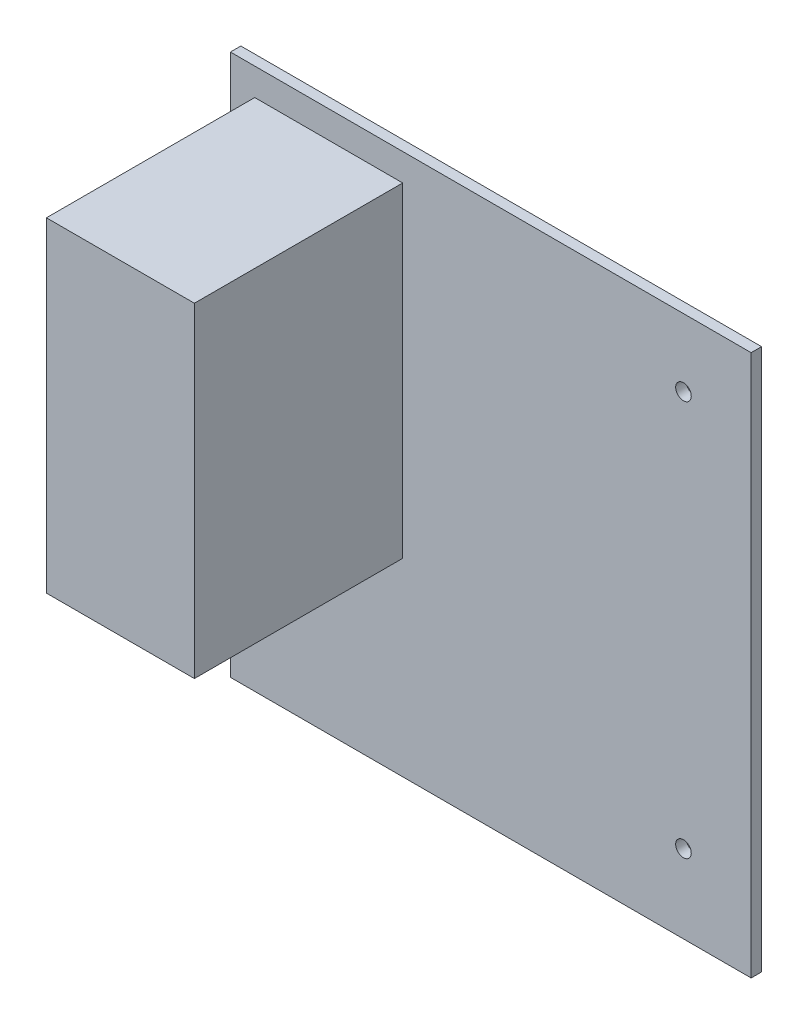
ISO-10303-21;
HEADER;
FILE_DESCRIPTION(('STEP AP214'),'2;1');
FILE_NAME('part.step','',(''),(''),'','','');
FILE_SCHEMA(('AUTOMOTIVE_DESIGN { 1 0 10303 214 1 1 1 1 }'));
ENDSEC;
DATA;
#1=APPLICATION_CONTEXT('core data for automotive mechanical design processes');
#2=APPLICATION_PROTOCOL_DEFINITION('international standard','automotive_design',2000,#1);
#3=PRODUCT_CONTEXT('',#1,'mechanical');
#4=PRODUCT('Part','Part','',(#3));
#5=PRODUCT_RELATED_PRODUCT_CATEGORY('part','',(#4));
#6=PRODUCT_DEFINITION_FORMATION('','',#4);
#7=PRODUCT_DEFINITION_CONTEXT('part definition',#1,'design');
#8=PRODUCT_DEFINITION('design','',#6,#7);
#9=PRODUCT_DEFINITION_SHAPE('','',#8);
#10=(LENGTH_UNIT() NAMED_UNIT(*) SI_UNIT(.MILLI.,.METRE.));
#11=(NAMED_UNIT(*) PLANE_ANGLE_UNIT() SI_UNIT($,.RADIAN.));
#12=(NAMED_UNIT(*) SI_UNIT($,.STERADIAN.) SOLID_ANGLE_UNIT());
#13=UNCERTAINTY_MEASURE_WITH_UNIT(LENGTH_MEASURE(1.E-05),#10,'distance_accuracy_value','');
#14=(GEOMETRIC_REPRESENTATION_CONTEXT(3) GLOBAL_UNCERTAINTY_ASSIGNED_CONTEXT((#13)) GLOBAL_UNIT_ASSIGNED_CONTEXT((#10,
#11,#12)) REPRESENTATION_CONTEXT('',''));
#15=CARTESIAN_POINT('',(0.,0.,0.));
#16=DIRECTION('',(0.,0.,1.));
#17=DIRECTION('',(1.,0.,0.));
#18=AXIS2_PLACEMENT_3D('',#15,#16,#17);
#19=CARTESIAN_POINT('',(0.,0.,2.));
#20=DIRECTION('',(0.,0.,1.));
#21=DIRECTION('',(1.,0.,0.));
#22=AXIS2_PLACEMENT_3D('',#19,#20,#21);
#23=PLANE('',#22);
#24=CARTESIAN_POINT('',(-44.,-37.,2.));
#25=DIRECTION('',(0.,0.,1.));
#26=DIRECTION('',(1.,0.,0.));
#27=AXIS2_PLACEMENT_3D('',#24,#25,#26);
#28=CIRCLE('',#27,1.5);
#29=CARTESIAN_POINT('',(-42.5,-37.,2.));
#30=VERTEX_POINT('',#29);
#31=EDGE_CURVE('E144',#30,#30,#28,.T.);
#32=ORIENTED_EDGE('',*,*,#31,.F.);
#33=EDGE_LOOP('',(#32));
#34=FACE_BOUND('',#33,.T.);
#35=CARTESIAN_POINT('',(37.,-37.,2.));
#36=DIRECTION('',(0.,0.,1.));
#37=DIRECTION('',(1.,0.,0.));
#38=AXIS2_PLACEMENT_3D('',#35,#36,#37);
#39=CIRCLE('',#38,1.5);
#40=CARTESIAN_POINT('',(38.5,-37.,2.));
#41=VERTEX_POINT('',#40);
#42=EDGE_CURVE('E150',#41,#41,#39,.T.);
#43=ORIENTED_EDGE('',*,*,#42,.F.);
#44=EDGE_LOOP('',(#43));
#45=FACE_BOUND('',#44,.T.);
#46=CARTESIAN_POINT('',(37.,39.,2.));
#47=DIRECTION('',(0.,0.,1.));
#48=DIRECTION('',(1.,0.,0.));
#49=AXIS2_PLACEMENT_3D('',#46,#47,#48);
#50=CIRCLE('',#49,1.5);
#51=CARTESIAN_POINT('',(38.5,39.,2.));
#52=VERTEX_POINT('',#51);
#53=EDGE_CURVE('E132',#52,#52,#50,.T.);
#54=ORIENTED_EDGE('',*,*,#53,.F.);
#55=EDGE_LOOP('',(#54));
#56=FACE_BOUND('',#55,.T.);
#57=DIRECTION('',(0.,1.,0.));
#58=VECTOR('',#57,1.);
#59=CARTESIAN_POINT('',(50.,52.,2.));
#60=LINE('',#59,#58);
#61=CARTESIAN_POINT('',(50.,-52.,2.));
#62=VERTEX_POINT('',#61);
#63=CARTESIAN_POINT('',(50.,52.,2.));
#64=VERTEX_POINT('',#63);
#65=EDGE_CURVE('E155',#62,#64,#60,.T.);
#66=ORIENTED_EDGE('',*,*,#65,.T.);
#67=DIRECTION('',(-1.,0.,0.));
#68=VECTOR('',#67,1.);
#69=CARTESIAN_POINT('',(-50.,52.,2.));
#70=LINE('',#69,#68);
#71=CARTESIAN_POINT('',(-50.,52.,2.));
#72=VERTEX_POINT('',#71);
#73=EDGE_CURVE('E85',#64,#72,#70,.T.);
#74=ORIENTED_EDGE('',*,*,#73,.T.);
#75=DIRECTION('',(0.,-1.,0.));
#76=VECTOR('',#75,1.);
#77=CARTESIAN_POINT('',(-50.,52.,2.));
#78=LINE('',#77,#76);
#79=CARTESIAN_POINT('',(-50.,-52.,2.));
#80=VERTEX_POINT('',#79);
#81=EDGE_CURVE('E158',#72,#80,#78,.T.);
#82=ORIENTED_EDGE('',*,*,#81,.T.);
#83=DIRECTION('',(1.,0.,0.));
#84=VECTOR('',#83,1.);
#85=CARTESIAN_POINT('',(-50.,-52.,2.));
#86=LINE('',#85,#84);
#87=EDGE_CURVE('E57',#80,#62,#86,.T.);
#88=ORIENTED_EDGE('',*,*,#87,.T.);
#89=EDGE_LOOP('',(#66,#74,#82,#88));
#90=FACE_BOUND('',#89,.T.);
#91=DIRECTION('',(1.,0.,0.));
#92=VECTOR('',#91,1.);
#93=CARTESIAN_POINT('',(-45.3319179954264,-15.6618985569423,2.));
#94=LINE('',#93,#92);
#95=CARTESIAN_POINT('',(-45.3319179954264,-15.6618985569423,2.));
#96=VERTEX_POINT('',#95);
#97=CARTESIAN_POINT('',(-16.9169811522494,-15.6618985569423,2.));
#98=VERTEX_POINT('',#97);
#99=EDGE_CURVE('E315',#96,#98,#94,.T.);
#100=ORIENTED_EDGE('',*,*,#99,.F.);
#101=DIRECTION('',(0.,-1.,0.));
#102=VECTOR('',#101,1.);
#103=CARTESIAN_POINT('',(-45.3319179954264,46.763842707719,2.));
#104=LINE('',#103,#102);
#105=CARTESIAN_POINT('',(-45.3319179954264,46.763842707719,2.));
#106=VERTEX_POINT('',#105);
#107=EDGE_CURVE('E130',#106,#96,#104,.T.);
#108=ORIENTED_EDGE('',*,*,#107,.F.);
#109=DIRECTION('',(-1.,0.,0.));
#110=VECTOR('',#109,1.);
#111=CARTESIAN_POINT('',(-45.3319179954264,46.763842707719,2.));
#112=LINE('',#111,#110);
#113=CARTESIAN_POINT('',(-16.9169811522494,46.763842707719,2.));
#114=VERTEX_POINT('',#113);
#115=EDGE_CURVE('E126',#114,#106,#112,.T.);
#116=ORIENTED_EDGE('',*,*,#115,.F.);
#117=DIRECTION('',(0.,1.,0.));
#118=VECTOR('',#117,1.);
#119=CARTESIAN_POINT('',(-16.9169811522494,46.763842707719,2.));
#120=LINE('',#119,#118);
#121=EDGE_CURVE('E312',#98,#114,#120,.T.);
#122=ORIENTED_EDGE('',*,*,#121,.F.);
#123=EDGE_LOOP('',(#100,#108,#116,#122));
#124=FACE_BOUND('',#123,.T.);
#125=ADVANCED_FACE('F33',(#34,#45,#56,#90,#124),#23,.T.);
#126=CARTESIAN_POINT('',(50.,52.,2.));
#127=DIRECTION('',(-1.,0.,0.));
#128=DIRECTION('',(0.,-1.,0.));
#129=AXIS2_PLACEMENT_3D('',#126,#127,#128);
#130=PLANE('',#129);
#131=DIRECTION('',(0.,1.,0.));
#132=VECTOR('',#131,1.);
#133=CARTESIAN_POINT('',(50.,52.,0.));
#134=LINE('',#133,#132);
#135=CARTESIAN_POINT('',(50.,-52.,0.));
#136=VERTEX_POINT('',#135);
#137=CARTESIAN_POINT('',(50.,52.,0.));
#138=VERTEX_POINT('',#137);
#139=EDGE_CURVE('E143',#136,#138,#134,.T.);
#140=ORIENTED_EDGE('',*,*,#139,.T.);
#141=DIRECTION('',(0.,0.,-1.));
#142=VECTOR('',#141,1.);
#143=CARTESIAN_POINT('',(50.,52.,2.));
#144=LINE('',#143,#142);
#145=EDGE_CURVE('E11',#64,#138,#144,.T.);
#146=ORIENTED_EDGE('',*,*,#145,.F.);
#147=ORIENTED_EDGE('',*,*,#65,.F.);
#148=DIRECTION('',(0.,0.,-1.));
#149=VECTOR('',#148,1.);
#150=CARTESIAN_POINT('',(50.,-52.,2.));
#151=LINE('',#150,#149);
#152=EDGE_CURVE('E161',#62,#136,#151,.T.);
#153=ORIENTED_EDGE('',*,*,#152,.T.);
#154=EDGE_LOOP('',(#140,#146,#147,#153));
#155=FACE_BOUND('',#154,.T.);
#156=ADVANCED_FACE('F35',(#155),#130,.F.);
#157=CARTESIAN_POINT('',(-50.,52.,2.));
#158=DIRECTION('',(0.,-1.,0.));
#159=DIRECTION('',(0.,0.,-1.));
#160=AXIS2_PLACEMENT_3D('',#157,#158,#159);
#161=PLANE('',#160);
#162=DIRECTION('',(-1.,0.,0.));
#163=VECTOR('',#162,1.);
#164=CARTESIAN_POINT('',(-50.,52.,0.));
#165=LINE('',#164,#163);
#166=CARTESIAN_POINT('',(-50.,52.,0.));
#167=VERTEX_POINT('',#166);
#168=EDGE_CURVE('E164',#138,#167,#165,.T.);
#169=ORIENTED_EDGE('',*,*,#168,.T.);
#170=DIRECTION('',(0.,0.,-1.));
#171=VECTOR('',#170,1.);
#172=CARTESIAN_POINT('',(-50.,52.,2.));
#173=LINE('',#172,#171);
#174=EDGE_CURVE('E41',#72,#167,#173,.T.);
#175=ORIENTED_EDGE('',*,*,#174,.F.);
#176=ORIENTED_EDGE('',*,*,#73,.F.);
#177=ORIENTED_EDGE('',*,*,#145,.T.);
#178=EDGE_LOOP('',(#169,#175,#176,#177));
#179=FACE_BOUND('',#178,.T.);
#180=ADVANCED_FACE('F193',(#179),#161,.F.);
#181=CARTESIAN_POINT('',(-50.,52.,2.));
#182=DIRECTION('',(1.,0.,0.));
#183=DIRECTION('',(0.,1.,0.));
#184=AXIS2_PLACEMENT_3D('',#181,#182,#183);
#185=PLANE('',#184);
#186=DIRECTION('',(0.,-1.,0.));
#187=VECTOR('',#186,1.);
#188=CARTESIAN_POINT('',(-50.,52.,0.));
#189=LINE('',#188,#187);
#190=CARTESIAN_POINT('',(-50.,-52.,0.));
#191=VERTEX_POINT('',#190);
#192=EDGE_CURVE('E166',#167,#191,#189,.T.);
#193=ORIENTED_EDGE('',*,*,#192,.T.);
#194=DIRECTION('',(0.,0.,-1.));
#195=VECTOR('',#194,1.);
#196=CARTESIAN_POINT('',(-50.,-52.,2.));
#197=LINE('',#196,#195);
#198=EDGE_CURVE('E170',#80,#191,#197,.T.);
#199=ORIENTED_EDGE('',*,*,#198,.F.);
#200=ORIENTED_EDGE('',*,*,#81,.F.);
#201=ORIENTED_EDGE('',*,*,#174,.T.);
#202=EDGE_LOOP('',(#193,#199,#200,#201));
#203=FACE_BOUND('',#202,.T.);
#204=ADVANCED_FACE('F175',(#203),#185,.F.);
#205=CARTESIAN_POINT('',(-50.,-52.,2.));
#206=DIRECTION('',(0.,1.,0.));
#207=DIRECTION('',(0.,0.,1.));
#208=AXIS2_PLACEMENT_3D('',#205,#206,#207);
#209=PLANE('',#208);
#210=DIRECTION('',(1.,0.,0.));
#211=VECTOR('',#210,1.);
#212=CARTESIAN_POINT('',(-50.,-52.,0.));
#213=LINE('',#212,#211);
#214=EDGE_CURVE('E78',#191,#136,#213,.T.);
#215=ORIENTED_EDGE('',*,*,#214,.T.);
#216=ORIENTED_EDGE('',*,*,#152,.F.);
#217=ORIENTED_EDGE('',*,*,#87,.F.);
#218=ORIENTED_EDGE('',*,*,#198,.T.);
#219=EDGE_LOOP('',(#215,#216,#217,#218));
#220=FACE_BOUND('',#219,.T.);
#221=ADVANCED_FACE('F183',(#220),#209,.F.);
#222=CARTESIAN_POINT('',(0.,0.,0.));
#223=DIRECTION('',(0.,0.,1.));
#224=DIRECTION('',(1.,0.,0.));
#225=AXIS2_PLACEMENT_3D('',#222,#223,#224);
#226=PLANE('',#225);
#227=CARTESIAN_POINT('',(-44.,-37.,0.));
#228=DIRECTION('',(0.,0.,1.));
#229=DIRECTION('',(1.,0.,0.));
#230=AXIS2_PLACEMENT_3D('',#227,#228,#229);
#231=CIRCLE('',#230,1.5);
#232=CARTESIAN_POINT('',(-42.5,-37.,0.));
#233=VERTEX_POINT('',#232);
#234=EDGE_CURVE('E140',#233,#233,#231,.T.);
#235=ORIENTED_EDGE('',*,*,#234,.T.);
#236=EDGE_LOOP('',(#235));
#237=FACE_BOUND('',#236,.T.);
#238=CARTESIAN_POINT('',(37.,-37.,0.));
#239=DIRECTION('',(0.,0.,1.));
#240=DIRECTION('',(1.,0.,0.));
#241=AXIS2_PLACEMENT_3D('',#238,#239,#240);
#242=CIRCLE('',#241,1.5);
#243=CARTESIAN_POINT('',(38.5,-37.,0.));
#244=VERTEX_POINT('',#243);
#245=EDGE_CURVE('E147',#244,#244,#242,.T.);
#246=ORIENTED_EDGE('',*,*,#245,.T.);
#247=EDGE_LOOP('',(#246));
#248=FACE_BOUND('',#247,.T.);
#249=CARTESIAN_POINT('',(37.,39.,0.));
#250=DIRECTION('',(0.,0.,1.));
#251=DIRECTION('',(1.,0.,0.));
#252=AXIS2_PLACEMENT_3D('',#249,#250,#251);
#253=CIRCLE('',#252,1.5);
#254=CARTESIAN_POINT('',(38.5,39.,0.));
#255=VERTEX_POINT('',#254);
#256=EDGE_CURVE('E135',#255,#255,#253,.T.);
#257=ORIENTED_EDGE('',*,*,#256,.T.);
#258=EDGE_LOOP('',(#257));
#259=FACE_BOUND('',#258,.T.);
#260=ORIENTED_EDGE('',*,*,#139,.F.);
#261=ORIENTED_EDGE('',*,*,#214,.F.);
#262=ORIENTED_EDGE('',*,*,#192,.F.);
#263=ORIENTED_EDGE('',*,*,#168,.F.);
#264=EDGE_LOOP('',(#260,#261,#262,#263));
#265=FACE_BOUND('',#264,.T.);
#266=ADVANCED_FACE('F179',(#237,#248,#259,#265),#226,.F.);
#267=CARTESIAN_POINT('',(37.,39.,0.));
#268=DIRECTION('',(0.,0.,1.));
#269=DIRECTION('',(1.,0.,0.));
#270=AXIS2_PLACEMENT_3D('',#267,#268,#269);
#271=CYLINDRICAL_SURFACE('',#270,1.5);
#272=ORIENTED_EDGE('',*,*,#256,.F.);
#273=EDGE_LOOP('',(#272));
#274=FACE_BOUND('',#273,.T.);
#275=ORIENTED_EDGE('',*,*,#53,.T.);
#276=EDGE_LOOP('',(#275));
#277=FACE_BOUND('',#276,.T.);
#278=ADVANCED_FACE('F190',(#274,#277),#271,.F.);
#279=CARTESIAN_POINT('',(37.,-37.,0.));
#280=DIRECTION('',(0.,0.,1.));
#281=DIRECTION('',(1.,0.,0.));
#282=AXIS2_PLACEMENT_3D('',#279,#280,#281);
#283=CYLINDRICAL_SURFACE('',#282,1.5);
#284=ORIENTED_EDGE('',*,*,#245,.F.);
#285=EDGE_LOOP('',(#284));
#286=FACE_BOUND('',#285,.T.);
#287=ORIENTED_EDGE('',*,*,#42,.T.);
#288=EDGE_LOOP('',(#287));
#289=FACE_BOUND('',#288,.T.);
#290=ADVANCED_FACE('F206',(#286,#289),#283,.F.);
#291=CARTESIAN_POINT('',(-44.,-37.,0.));
#292=DIRECTION('',(0.,0.,1.));
#293=DIRECTION('',(1.,0.,0.));
#294=AXIS2_PLACEMENT_3D('',#291,#292,#293);
#295=CYLINDRICAL_SURFACE('',#294,1.5);
#296=ORIENTED_EDGE('',*,*,#234,.F.);
#297=EDGE_LOOP('',(#296));
#298=FACE_BOUND('',#297,.T.);
#299=ORIENTED_EDGE('',*,*,#31,.T.);
#300=EDGE_LOOP('',(#299));
#301=FACE_BOUND('',#300,.T.);
#302=ADVANCED_FACE('F210',(#298,#301),#295,.F.);
#303=CARTESIAN_POINT('',(-45.3319179954264,46.763842707719,42.));
#304=DIRECTION('',(1.,0.,0.));
#305=DIRECTION('',(0.,0.,-1.));
#306=AXIS2_PLACEMENT_3D('',#303,#304,#305);
#307=PLANE('',#306);
#308=ORIENTED_EDGE('',*,*,#107,.T.);
#309=DIRECTION('',(0.,0.,-1.));
#310=VECTOR('',#309,1.);
#311=CARTESIAN_POINT('',(-45.3319179954264,-15.6618985569423,42.));
#312=LINE('',#311,#310);
#313=CARTESIAN_POINT('',(-45.3319179954264,-15.6618985569423,42.));
#314=VERTEX_POINT('',#313);
#315=EDGE_CURVE('E111',#314,#96,#312,.T.);
#316=ORIENTED_EDGE('',*,*,#315,.F.);
#317=DIRECTION('',(0.,-1.,0.));
#318=VECTOR('',#317,1.);
#319=CARTESIAN_POINT('',(-45.3319179954264,46.763842707719,42.));
#320=LINE('',#319,#318);
#321=CARTESIAN_POINT('',(-45.3319179954264,46.763842707719,42.));
#322=VERTEX_POINT('',#321);
#323=EDGE_CURVE('E118',#322,#314,#320,.T.);
#324=ORIENTED_EDGE('',*,*,#323,.F.);
#325=DIRECTION('',(0.,0.,-1.));
#326=VECTOR('',#325,1.);
#327=CARTESIAN_POINT('',(-45.3319179954264,46.763842707719,42.));
#328=LINE('',#327,#326);
#329=EDGE_CURVE('E309',#322,#106,#328,.T.);
#330=ORIENTED_EDGE('',*,*,#329,.T.);
#331=EDGE_LOOP('',(#308,#316,#324,#330));
#332=FACE_BOUND('',#331,.T.);
#333=ADVANCED_FACE('F128',(#332),#307,.F.);
#334=CARTESIAN_POINT('',(-45.3319179954264,-15.6618985569423,42.));
#335=DIRECTION('',(0.,1.,0.));
#336=DIRECTION('',(0.,0.,1.));
#337=AXIS2_PLACEMENT_3D('',#334,#335,#336);
#338=PLANE('',#337);
#339=ORIENTED_EDGE('',*,*,#99,.T.);
#340=DIRECTION('',(0.,0.,-1.));
#341=VECTOR('',#340,1.);
#342=CARTESIAN_POINT('',(-16.9169811522494,-15.6618985569423,42.));
#343=LINE('',#342,#341);
#344=CARTESIAN_POINT('',(-16.9169811522494,-15.6618985569423,42.));
#345=VERTEX_POINT('',#344);
#346=EDGE_CURVE('E114',#345,#98,#343,.T.);
#347=ORIENTED_EDGE('',*,*,#346,.F.);
#348=DIRECTION('',(1.,0.,0.));
#349=VECTOR('',#348,1.);
#350=CARTESIAN_POINT('',(-45.3319179954264,-15.6618985569423,42.));
#351=LINE('',#350,#349);
#352=EDGE_CURVE('E107',#314,#345,#351,.T.);
#353=ORIENTED_EDGE('',*,*,#352,.F.);
#354=ORIENTED_EDGE('',*,*,#315,.T.);
#355=EDGE_LOOP('',(#339,#347,#353,#354));
#356=FACE_BOUND('',#355,.T.);
#357=ADVANCED_FACE('F109',(#356),#338,.F.);
#358=CARTESIAN_POINT('',(-16.9169811522494,46.763842707719,42.));
#359=DIRECTION('',(-1.,0.,0.));
#360=DIRECTION('',(0.,0.,1.));
#361=AXIS2_PLACEMENT_3D('',#358,#359,#360);
#362=PLANE('',#361);
#363=ORIENTED_EDGE('',*,*,#121,.T.);
#364=DIRECTION('',(0.,0.,-1.));
#365=VECTOR('',#364,1.);
#366=CARTESIAN_POINT('',(-16.9169811522494,46.763842707719,42.));
#367=LINE('',#366,#365);
#368=CARTESIAN_POINT('',(-16.9169811522494,46.763842707719,42.));
#369=VERTEX_POINT('',#368);
#370=EDGE_CURVE('E48',#369,#114,#367,.T.);
#371=ORIENTED_EDGE('',*,*,#370,.F.);
#372=DIRECTION('',(0.,1.,0.));
#373=VECTOR('',#372,1.);
#374=CARTESIAN_POINT('',(-16.9169811522494,46.763842707719,42.));
#375=LINE('',#374,#373);
#376=EDGE_CURVE('E117',#345,#369,#375,.T.);
#377=ORIENTED_EDGE('',*,*,#376,.F.);
#378=ORIENTED_EDGE('',*,*,#346,.T.);
#379=EDGE_LOOP('',(#363,#371,#377,#378));
#380=FACE_BOUND('',#379,.T.);
#381=ADVANCED_FACE('F219',(#380),#362,.F.);
#382=CARTESIAN_POINT('',(-45.3319179954264,46.763842707719,42.));
#383=DIRECTION('',(0.,-1.,0.));
#384=DIRECTION('',(0.,0.,-1.));
#385=AXIS2_PLACEMENT_3D('',#382,#383,#384);
#386=PLANE('',#385);
#387=ORIENTED_EDGE('',*,*,#115,.T.);
#388=ORIENTED_EDGE('',*,*,#329,.F.);
#389=DIRECTION('',(-1.,0.,0.));
#390=VECTOR('',#389,1.);
#391=CARTESIAN_POINT('',(-45.3319179954264,46.763842707719,42.));
#392=LINE('',#391,#390);
#393=EDGE_CURVE('E122',#369,#322,#392,.T.);
#394=ORIENTED_EDGE('',*,*,#393,.F.);
#395=ORIENTED_EDGE('',*,*,#370,.T.);
#396=EDGE_LOOP('',(#387,#388,#394,#395));
#397=FACE_BOUND('',#396,.T.);
#398=ADVANCED_FACE('F222',(#397),#386,.F.);
#399=CARTESIAN_POINT('',(0.,0.,42.));
#400=DIRECTION('',(0.,0.,1.));
#401=DIRECTION('',(1.,0.,0.));
#402=AXIS2_PLACEMENT_3D('',#399,#400,#401);
#403=PLANE('',#402);
#404=ORIENTED_EDGE('',*,*,#323,.T.);
#405=ORIENTED_EDGE('',*,*,#352,.T.);
#406=ORIENTED_EDGE('',*,*,#376,.T.);
#407=ORIENTED_EDGE('',*,*,#393,.T.);
#408=EDGE_LOOP('',(#404,#405,#406,#407));
#409=FACE_BOUND('',#408,.T.);
#410=ADVANCED_FACE('F121',(#409),#403,.T.);
#411=CLOSED_SHELL('',(#125,#156,#180,#204,#221,#266,#278,#290,#302,#333,#357,#381,#398,#410));
#412=MANIFOLD_SOLID_BREP('B2',#411);
#413=ADVANCED_BREP_SHAPE_REPRESENTATION('',(#18,#412),#14);
#414=SHAPE_DEFINITION_REPRESENTATION(#9,#413);
ENDSEC;
END-ISO-10303-21;
